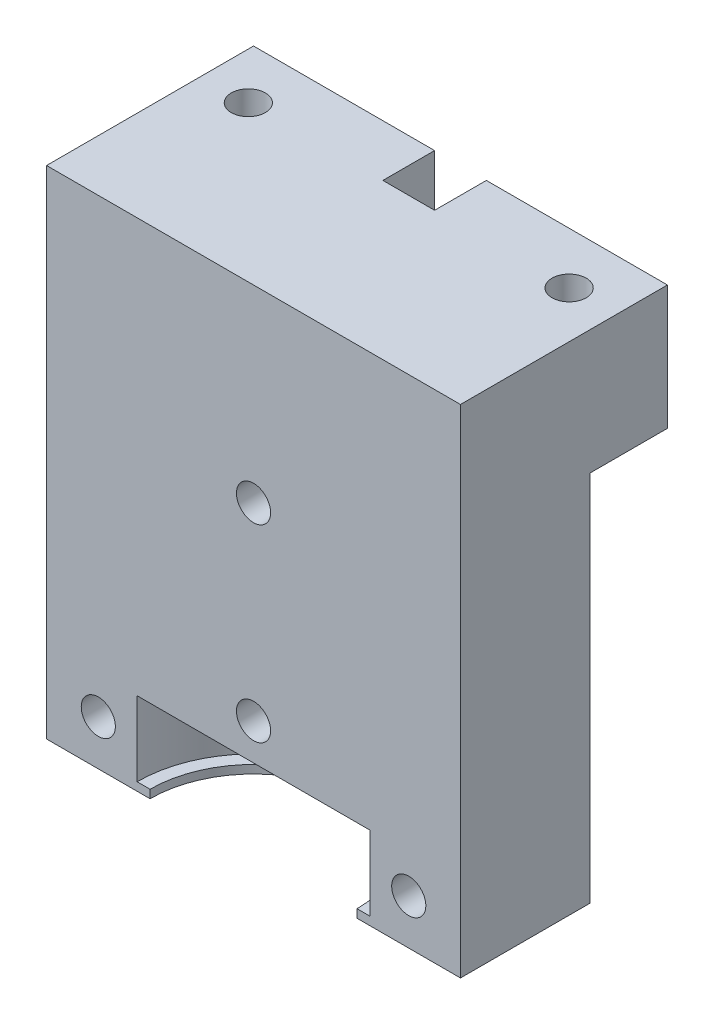
ISO-10303-21;
HEADER;
FILE_DESCRIPTION(('STEP AP214'),'2;1');
FILE_NAME('part.step','',(''),(''),'','','');
FILE_SCHEMA(('AUTOMOTIVE_DESIGN { 1 0 10303 214 1 1 1 1 }'));
ENDSEC;
DATA;
#1=APPLICATION_CONTEXT('core data for automotive mechanical design processes');
#2=APPLICATION_PROTOCOL_DEFINITION('international standard','automotive_design',2000,#1);
#3=PRODUCT_CONTEXT('',#1,'mechanical');
#4=PRODUCT('Part','Part','',(#3));
#5=PRODUCT_RELATED_PRODUCT_CATEGORY('part','',(#4));
#6=PRODUCT_DEFINITION_FORMATION('','',#4);
#7=PRODUCT_DEFINITION_CONTEXT('part definition',#1,'design');
#8=PRODUCT_DEFINITION('design','',#6,#7);
#9=PRODUCT_DEFINITION_SHAPE('','',#8);
#10=(LENGTH_UNIT() NAMED_UNIT(*) SI_UNIT(.MILLI.,.METRE.));
#11=(NAMED_UNIT(*) PLANE_ANGLE_UNIT() SI_UNIT($,.RADIAN.));
#12=(NAMED_UNIT(*) SI_UNIT($,.STERADIAN.) SOLID_ANGLE_UNIT());
#13=UNCERTAINTY_MEASURE_WITH_UNIT(LENGTH_MEASURE(1.E-05),#10,'distance_accuracy_value','');
#14=(GEOMETRIC_REPRESENTATION_CONTEXT(3) GLOBAL_UNCERTAINTY_ASSIGNED_CONTEXT((#13)) GLOBAL_UNIT_ASSIGNED_CONTEXT((#10,
#11,#12)) REPRESENTATION_CONTEXT('',''));
#15=CARTESIAN_POINT('',(0.,0.,0.));
#16=DIRECTION('',(0.,0.,1.));
#17=DIRECTION('',(1.,0.,0.));
#18=AXIS2_PLACEMENT_3D('',#15,#16,#17);
#19=CARTESIAN_POINT('',(20.,-48.,-20.));
#20=DIRECTION('',(0.,0.,-1.));
#21=DIRECTION('',(-1.,0.,0.));
#22=AXIS2_PLACEMENT_3D('',#19,#20,#21);
#23=PLANE('',#22);
#24=DIRECTION('',(0.,-1.,0.));
#25=VECTOR('',#24,1.);
#26=CARTESIAN_POINT('',(-2.5,0.,-20.));
#27=LINE('',#26,#25);
#28=CARTESIAN_POINT('',(-2.5,0.,-20.));
#29=VERTEX_POINT('',#28);
#30=CARTESIAN_POINT('',(-2.5,-12.,-20.));
#31=VERTEX_POINT('',#30);
#32=EDGE_CURVE('E140',#29,#31,#27,.T.);
#33=ORIENTED_EDGE('',*,*,#32,.T.);
#34=DIRECTION('',(1.,0.,0.));
#35=VECTOR('',#34,1.);
#36=CARTESIAN_POINT('',(-20.,-12.,-20.));
#37=LINE('',#36,#35);
#38=CARTESIAN_POINT('',(-20.,-12.,-20.));
#39=VERTEX_POINT('',#38);
#40=EDGE_CURVE('E289',#39,#31,#37,.T.);
#41=ORIENTED_EDGE('',*,*,#40,.F.);
#42=DIRECTION('',(0.,1.,0.));
#43=VECTOR('',#42,1.);
#44=CARTESIAN_POINT('',(-20.,-48.,-20.));
#45=LINE('',#44,#43);
#46=CARTESIAN_POINT('',(-20.,0.,-20.));
#47=VERTEX_POINT('',#46);
#48=EDGE_CURVE('E164',#39,#47,#45,.T.);
#49=ORIENTED_EDGE('',*,*,#48,.T.);
#50=DIRECTION('',(-1.,0.,0.));
#51=VECTOR('',#50,1.);
#52=CARTESIAN_POINT('',(20.,0.,-20.));
#53=LINE('',#52,#51);
#54=EDGE_CURVE('E156',#29,#47,#53,.T.);
#55=ORIENTED_EDGE('',*,*,#54,.F.);
#56=EDGE_LOOP('',(#33,#41,#49,#55));
#57=FACE_BOUND('',#56,.T.);
#58=ADVANCED_FACE('F35',(#57),#23,.T.);
#59=DIRECTION('',(0.,-1.,0.));
#60=VECTOR('',#59,1.);
#61=CARTESIAN_POINT('',(2.5,0.,-20.));
#62=LINE('',#61,#60);
#63=CARTESIAN_POINT('',(2.5,0.,-20.));
#64=VERTEX_POINT('',#63);
#65=CARTESIAN_POINT('',(2.5,-12.,-20.));
#66=VERTEX_POINT('',#65);
#67=EDGE_CURVE('E52',#64,#66,#62,.T.);
#68=ORIENTED_EDGE('',*,*,#67,.F.);
#69=CARTESIAN_POINT('',(20.,0.,-20.));
#70=VERTEX_POINT('',#69);
#71=EDGE_CURVE('E166',#70,#64,#53,.T.);
#72=ORIENTED_EDGE('',*,*,#71,.F.);
#73=DIRECTION('',(0.,1.,0.));
#74=VECTOR('',#73,1.);
#75=CARTESIAN_POINT('',(20.,-48.,-20.));
#76=LINE('',#75,#74);
#77=CARTESIAN_POINT('',(20.,-12.,-20.));
#78=VERTEX_POINT('',#77);
#79=EDGE_CURVE('E178',#78,#70,#76,.T.);
#80=ORIENTED_EDGE('',*,*,#79,.F.);
#81=EDGE_CURVE('E279',#66,#78,#37,.T.);
#82=ORIENTED_EDGE('',*,*,#81,.F.);
#83=EDGE_LOOP('',(#68,#72,#80,#82));
#84=FACE_BOUND('',#83,.T.);
#85=ADVANCED_FACE('F303',(#84),#23,.T.);
#86=CARTESIAN_POINT('',(15.5,0.,-15.));
#87=DIRECTION('',(0.,1.,0.));
#88=DIRECTION('',(0.,0.,1.));
#89=AXIS2_PLACEMENT_3D('',#86,#87,#88);
#90=CYLINDRICAL_SURFACE('',#89,1.64999999999999);
#91=CARTESIAN_POINT('',(15.5,0.,-15.));
#92=DIRECTION('',(0.,1.,0.));
#93=DIRECTION('',(0.,0.,1.));
#94=AXIS2_PLACEMENT_3D('',#91,#92,#93);
#95=CIRCLE('',#94,1.64999999999999);
#96=CARTESIAN_POINT('',(15.5,0.,-13.35));
#97=VERTEX_POINT('',#96);
#98=EDGE_CURVE('E255',#97,#97,#95,.T.);
#99=ORIENTED_EDGE('',*,*,#98,.T.);
#100=EDGE_LOOP('',(#99));
#101=FACE_BOUND('',#100,.T.);
#102=CARTESIAN_POINT('',(15.5,-12.,-15.));
#103=DIRECTION('',(0.,-1.,0.));
#104=DIRECTION('',(0.,0.,-1.));
#105=AXIS2_PLACEMENT_3D('',#102,#103,#104);
#106=CIRCLE('',#105,1.64999999999999);
#107=CARTESIAN_POINT('',(15.5,-12.,-16.65));
#108=VERTEX_POINT('',#107);
#109=EDGE_CURVE('E211',#108,#108,#106,.F.);
#110=ORIENTED_EDGE('',*,*,#109,.F.);
#111=EDGE_LOOP('',(#110));
#112=FACE_BOUND('',#111,.T.);
#113=ADVANCED_FACE('F324',(#101,#112),#90,.F.);
#114=CARTESIAN_POINT('',(-15.5,0.,-15.));
#115=DIRECTION('',(0.,1.,0.));
#116=DIRECTION('',(0.,0.,1.));
#117=AXIS2_PLACEMENT_3D('',#114,#115,#116);
#118=CYLINDRICAL_SURFACE('',#117,1.64999999999999);
#119=CARTESIAN_POINT('',(-15.5,0.,-15.));
#120=DIRECTION('',(0.,1.,0.));
#121=DIRECTION('',(0.,0.,1.));
#122=AXIS2_PLACEMENT_3D('',#119,#120,#121);
#123=CIRCLE('',#122,1.64999999999999);
#124=CARTESIAN_POINT('',(-15.5,0.,-13.35));
#125=VERTEX_POINT('',#124);
#126=EDGE_CURVE('E251',#125,#125,#123,.T.);
#127=ORIENTED_EDGE('',*,*,#126,.T.);
#128=EDGE_LOOP('',(#127));
#129=FACE_BOUND('',#128,.T.);
#130=CARTESIAN_POINT('',(-15.5,-12.,-15.));
#131=DIRECTION('',(0.,-1.,0.));
#132=DIRECTION('',(0.,0.,-1.));
#133=AXIS2_PLACEMENT_3D('',#130,#131,#132);
#134=CIRCLE('',#133,1.64999999999999);
#135=CARTESIAN_POINT('',(-15.5,-12.,-16.65));
#136=VERTEX_POINT('',#135);
#137=EDGE_CURVE('E39',#136,#136,#134,.F.);
#138=ORIENTED_EDGE('',*,*,#137,.F.);
#139=EDGE_LOOP('',(#138));
#140=FACE_BOUND('',#139,.T.);
#141=ADVANCED_FACE('F335',(#129,#140),#118,.F.);
#142=CARTESIAN_POINT('',(-20.,-48.,0.));
#143=DIRECTION('',(0.,0.,-1.));
#144=DIRECTION('',(-1.,0.,0.));
#145=AXIS2_PLACEMENT_3D('',#142,#143,#144);
#146=PLANE('',#145);
#147=CARTESIAN_POINT('',(-15.,-43.628125,0.));
#148=DIRECTION('',(0.,0.,-1.));
#149=DIRECTION('',(-1.,0.,0.));
#150=AXIS2_PLACEMENT_3D('',#147,#148,#149);
#151=CIRCLE('',#150,1.65);
#152=CARTESIAN_POINT('',(-16.65,-43.628125,0.));
#153=VERTEX_POINT('',#152);
#154=EDGE_CURVE('E214',#153,#153,#151,.T.);
#155=ORIENTED_EDGE('',*,*,#154,.T.);
#156=EDGE_LOOP('',(#155));
#157=FACE_BOUND('',#156,.T.);
#158=CARTESIAN_POINT('',(15.,-43.628125,0.));
#159=DIRECTION('',(0.,0.,-1.));
#160=DIRECTION('',(-1.,0.,0.));
#161=AXIS2_PLACEMENT_3D('',#158,#159,#160);
#162=CIRCLE('',#161,1.65);
#163=CARTESIAN_POINT('',(13.35,-43.628125,0.));
#164=VERTEX_POINT('',#163);
#165=EDGE_CURVE('E217',#164,#164,#162,.T.);
#166=ORIENTED_EDGE('',*,*,#165,.T.);
#167=EDGE_LOOP('',(#166));
#168=FACE_BOUND('',#167,.T.);
#169=CARTESIAN_POINT('',(0.,-36.484375,0.));
#170=DIRECTION('',(0.,0.,-1.));
#171=DIRECTION('',(-1.,0.,0.));
#172=AXIS2_PLACEMENT_3D('',#169,#170,#171);
#173=CIRCLE('',#172,1.65);
#174=CARTESIAN_POINT('',(-1.65,-36.484375,0.));
#175=VERTEX_POINT('',#174);
#176=EDGE_CURVE('E220',#175,#175,#173,.T.);
#177=ORIENTED_EDGE('',*,*,#176,.T.);
#178=EDGE_LOOP('',(#177));
#179=FACE_BOUND('',#178,.T.);
#180=CARTESIAN_POINT('',(0.,-18.2421875,0.));
#181=DIRECTION('',(0.,0.,-1.));
#182=DIRECTION('',(-1.,0.,0.));
#183=AXIS2_PLACEMENT_3D('',#180,#181,#182);
#184=CIRCLE('',#183,1.65);
#185=CARTESIAN_POINT('',(-1.65,-18.2421875,0.));
#186=VERTEX_POINT('',#185);
#187=EDGE_CURVE('E223',#186,#186,#184,.T.);
#188=ORIENTED_EDGE('',*,*,#187,.T.);
#189=EDGE_LOOP('',(#188));
#190=FACE_BOUND('',#189,.T.);
#191=DIRECTION('',(1.,0.,0.));
#192=VECTOR('',#191,1.);
#193=CARTESIAN_POINT('',(-20.,-47.2,0.));
#194=LINE('',#193,#192);
#195=CARTESIAN_POINT('',(10.,-47.2,0.));
#196=VERTEX_POINT('',#195);
#197=CARTESIAN_POINT('',(11.25,-47.2,0.));
#198=VERTEX_POINT('',#197);
#199=EDGE_CURVE('E44',#196,#198,#194,.T.);
#200=ORIENTED_EDGE('',*,*,#199,.F.);
#201=DIRECTION('',(0.,-1.,0.));
#202=VECTOR('',#201,1.);
#203=CARTESIAN_POINT('',(10.,0.001000000000001,0.));
#204=LINE('',#203,#202);
#205=CARTESIAN_POINT('',(10.,-48.,0.));
#206=VERTEX_POINT('',#205);
#207=EDGE_CURVE('E228',#206,#196,#204,.F.);
#208=ORIENTED_EDGE('',*,*,#207,.F.);
#209=DIRECTION('',(-1.,0.,0.));
#210=VECTOR('',#209,1.);
#211=CARTESIAN_POINT('',(-20.,-48.,0.));
#212=LINE('',#211,#210);
#213=CARTESIAN_POINT('',(20.,-48.,0.));
#214=VERTEX_POINT('',#213);
#215=EDGE_CURVE('E242',#214,#206,#212,.T.);
#216=ORIENTED_EDGE('',*,*,#215,.F.);
#217=DIRECTION('',(0.,1.,0.));
#218=VECTOR('',#217,1.);
#219=CARTESIAN_POINT('',(20.,-48.,0.));
#220=LINE('',#219,#218);
#221=CARTESIAN_POINT('',(20.,0.,0.));
#222=VERTEX_POINT('',#221);
#223=EDGE_CURVE('E245',#214,#222,#220,.T.);
#224=ORIENTED_EDGE('',*,*,#223,.T.);
#225=DIRECTION('',(-1.,0.,0.));
#226=VECTOR('',#225,1.);
#227=CARTESIAN_POINT('',(-20.,0.,0.));
#228=LINE('',#227,#226);
#229=CARTESIAN_POINT('',(-20.,0.,0.));
#230=VERTEX_POINT('',#229);
#231=EDGE_CURVE('E241',#222,#230,#228,.T.);
#232=ORIENTED_EDGE('',*,*,#231,.T.);
#233=DIRECTION('',(0.,1.,0.));
#234=VECTOR('',#233,1.);
#235=CARTESIAN_POINT('',(-20.,-48.,0.));
#236=LINE('',#235,#234);
#237=CARTESIAN_POINT('',(-20.,-48.,0.));
#238=VERTEX_POINT('',#237);
#239=EDGE_CURVE('E248',#238,#230,#236,.T.);
#240=ORIENTED_EDGE('',*,*,#239,.F.);
#241=CARTESIAN_POINT('',(-10.,-48.,0.));
#242=VERTEX_POINT('',#241);
#243=EDGE_CURVE('E246',#242,#238,#212,.T.);
#244=ORIENTED_EDGE('',*,*,#243,.F.);
#245=DIRECTION('',(0.,-1.,0.));
#246=VECTOR('',#245,1.);
#247=CARTESIAN_POINT('',(-10.,0.001000000000001,0.));
#248=LINE('',#247,#246);
#249=CARTESIAN_POINT('',(-10.,-47.2,0.));
#250=VERTEX_POINT('',#249);
#251=EDGE_CURVE('E226',#250,#242,#248,.T.);
#252=ORIENTED_EDGE('',*,*,#251,.F.);
#253=CARTESIAN_POINT('',(-11.25,-47.2,0.));
#254=VERTEX_POINT('',#253);
#255=EDGE_CURVE('E11',#254,#250,#194,.T.);
#256=ORIENTED_EDGE('',*,*,#255,.F.);
#257=DIRECTION('',(0.,1.,0.));
#258=VECTOR('',#257,1.);
#259=CARTESIAN_POINT('',(-11.25,0.,0.));
#260=LINE('',#259,#258);
#261=CARTESIAN_POINT('',(-11.25,-40.,0.));
#262=VERTEX_POINT('',#261);
#263=EDGE_CURVE('E185',#262,#254,#260,.F.);
#264=ORIENTED_EDGE('',*,*,#263,.F.);
#265=DIRECTION('',(-1.,0.,0.));
#266=VECTOR('',#265,1.);
#267=CARTESIAN_POINT('',(-20.,-40.,0.));
#268=LINE('',#267,#266);
#269=CARTESIAN_POINT('',(11.25,-40.,0.));
#270=VERTEX_POINT('',#269);
#271=EDGE_CURVE('E177',#270,#262,#268,.T.);
#272=ORIENTED_EDGE('',*,*,#271,.F.);
#273=DIRECTION('',(0.,1.,0.));
#274=VECTOR('',#273,1.);
#275=CARTESIAN_POINT('',(11.25,0.,0.));
#276=LINE('',#275,#274);
#277=EDGE_CURVE('E182',#198,#270,#276,.T.);
#278=ORIENTED_EDGE('',*,*,#277,.F.);
#279=EDGE_LOOP('',(#200,#208,#216,#224,#232,#240,#244,#252,#256,#264,#272,#278));
#280=FACE_BOUND('',#279,.T.);
#281=ADVANCED_FACE('F267',(#157,#168,#179,#190,#280),#146,.F.);
#282=CARTESIAN_POINT('',(-20.,-48.,-20.));
#283=DIRECTION('',(-1.,0.,0.));
#284=DIRECTION('',(0.,0.,1.));
#285=AXIS2_PLACEMENT_3D('',#282,#283,#284);
#286=PLANE('',#285);
#287=DIRECTION('',(0.,-1.,0.));
#288=VECTOR('',#287,1.);
#289=CARTESIAN_POINT('',(-20.,-12.,-12.5));
#290=LINE('',#289,#288);
#291=CARTESIAN_POINT('',(-20.,-12.,-12.5));
#292=VERTEX_POINT('',#291);
#293=CARTESIAN_POINT('',(-20.,-48.,-12.5));
#294=VERTEX_POINT('',#293);
#295=EDGE_CURVE('E189',#292,#294,#290,.T.);
#296=ORIENTED_EDGE('',*,*,#295,.T.);
#297=DIRECTION('',(0.,0.,1.));
#298=VECTOR('',#297,1.);
#299=CARTESIAN_POINT('',(-20.,-48.,-20.));
#300=LINE('',#299,#298);
#301=EDGE_CURVE('E170',#294,#238,#300,.T.);
#302=ORIENTED_EDGE('',*,*,#301,.T.);
#303=ORIENTED_EDGE('',*,*,#239,.T.);
#304=DIRECTION('',(0.,0.,1.));
#305=VECTOR('',#304,1.);
#306=CARTESIAN_POINT('',(-20.,0.,-20.));
#307=LINE('',#306,#305);
#308=EDGE_CURVE('E172',#47,#230,#307,.T.);
#309=ORIENTED_EDGE('',*,*,#308,.F.);
#310=ORIENTED_EDGE('',*,*,#48,.F.);
#311=DIRECTION('',(0.,0.,-1.));
#312=VECTOR('',#311,1.);
#313=CARTESIAN_POINT('',(-20.,-12.,-12.5));
#314=LINE('',#313,#312);
#315=EDGE_CURVE('E277',#292,#39,#314,.T.);
#316=ORIENTED_EDGE('',*,*,#315,.F.);
#317=EDGE_LOOP('',(#296,#302,#303,#309,#310,#316));
#318=FACE_BOUND('',#317,.T.);
#319=ADVANCED_FACE('F37',(#318),#286,.T.);
#320=CARTESIAN_POINT('',(20.,-48.,-20.));
#321=DIRECTION('',(1.,0.,0.));
#322=DIRECTION('',(0.,0.,-1.));
#323=AXIS2_PLACEMENT_3D('',#320,#321,#322);
#324=PLANE('',#323);
#325=DIRECTION('',(0.,-1.,0.));
#326=VECTOR('',#325,1.);
#327=CARTESIAN_POINT('',(20.,-12.,-12.5));
#328=LINE('',#327,#326);
#329=CARTESIAN_POINT('',(20.,-12.,-12.5));
#330=VERTEX_POINT('',#329);
#331=CARTESIAN_POINT('',(20.,-48.,-12.5));
#332=VERTEX_POINT('',#331);
#333=EDGE_CURVE('E60',#330,#332,#328,.T.);
#334=ORIENTED_EDGE('',*,*,#333,.F.);
#335=DIRECTION('',(0.,0.,1.));
#336=VECTOR('',#335,1.);
#337=CARTESIAN_POINT('',(20.,-12.,-12.5));
#338=LINE('',#337,#336);
#339=EDGE_CURVE('E291',#78,#330,#338,.T.);
#340=ORIENTED_EDGE('',*,*,#339,.F.);
#341=ORIENTED_EDGE('',*,*,#79,.T.);
#342=DIRECTION('',(0.,0.,-1.));
#343=VECTOR('',#342,1.);
#344=CARTESIAN_POINT('',(20.,0.,-20.));
#345=LINE('',#344,#343);
#346=EDGE_CURVE('E167',#222,#70,#345,.T.);
#347=ORIENTED_EDGE('',*,*,#346,.F.);
#348=ORIENTED_EDGE('',*,*,#223,.F.);
#349=DIRECTION('',(0.,0.,-1.));
#350=VECTOR('',#349,1.);
#351=CARTESIAN_POINT('',(20.,-48.,-20.));
#352=LINE('',#351,#350);
#353=EDGE_CURVE('E180',#214,#332,#352,.T.);
#354=ORIENTED_EDGE('',*,*,#353,.T.);
#355=EDGE_LOOP('',(#334,#340,#341,#347,#348,#354));
#356=FACE_BOUND('',#355,.T.);
#357=ADVANCED_FACE('F273',(#356),#324,.T.);
#358=CARTESIAN_POINT('',(0.,-48.,0.));
#359=DIRECTION('',(0.,-1.,0.));
#360=DIRECTION('',(0.,0.,-1.));
#361=AXIS2_PLACEMENT_3D('',#358,#359,#360);
#362=PLANE('',#361);
#363=DIRECTION('',(-1.,0.,0.));
#364=VECTOR('',#363,1.);
#365=CARTESIAN_POINT('',(-20.,-48.,-12.5));
#366=LINE('',#365,#364);
#367=EDGE_CURVE('E203',#332,#294,#366,.T.);
#368=ORIENTED_EDGE('',*,*,#367,.F.);
#369=ORIENTED_EDGE('',*,*,#353,.F.);
#370=ORIENTED_EDGE('',*,*,#215,.T.);
#371=CARTESIAN_POINT('',(0.,-48.,0.));
#372=DIRECTION('',(0.,-1.,0.));
#373=DIRECTION('',(0.,0.,-1.));
#374=AXIS2_PLACEMENT_3D('',#371,#372,#373);
#375=CIRCLE('',#374,10.);
#376=EDGE_CURVE('E230',#242,#206,#375,.T.);
#377=ORIENTED_EDGE('',*,*,#376,.F.);
#378=ORIENTED_EDGE('',*,*,#243,.T.);
#379=ORIENTED_EDGE('',*,*,#301,.F.);
#380=EDGE_LOOP('',(#368,#369,#370,#377,#378,#379));
#381=FACE_BOUND('',#380,.T.);
#382=ADVANCED_FACE('F275',(#381),#362,.T.);
#383=CARTESIAN_POINT('',(0.,0.,0.));
#384=DIRECTION('',(0.,-1.,0.));
#385=DIRECTION('',(0.,0.,-1.));
#386=AXIS2_PLACEMENT_3D('',#383,#384,#385);
#387=PLANE('',#386);
#388=ORIENTED_EDGE('',*,*,#126,.F.);
#389=EDGE_LOOP('',(#388));
#390=FACE_BOUND('',#389,.T.);
#391=ORIENTED_EDGE('',*,*,#98,.F.);
#392=EDGE_LOOP('',(#391));
#393=FACE_BOUND('',#392,.T.);
#394=DIRECTION('',(-1.,0.,0.));
#395=VECTOR('',#394,1.);
#396=CARTESIAN_POINT('',(-2.5,0.,-15.));
#397=LINE('',#396,#395);
#398=CARTESIAN_POINT('',(2.5,0.,-15.));
#399=VERTEX_POINT('',#398);
#400=CARTESIAN_POINT('',(-2.5,0.,-15.));
#401=VERTEX_POINT('',#400);
#402=EDGE_CURVE('E151',#399,#401,#397,.T.);
#403=ORIENTED_EDGE('',*,*,#402,.T.);
#404=DIRECTION('',(0.,0.,-1.));
#405=VECTOR('',#404,1.);
#406=CARTESIAN_POINT('',(-2.5,0.,-20.));
#407=LINE('',#406,#405);
#408=EDGE_CURVE('E143',#401,#29,#407,.T.);
#409=ORIENTED_EDGE('',*,*,#408,.T.);
#410=ORIENTED_EDGE('',*,*,#54,.T.);
#411=ORIENTED_EDGE('',*,*,#308,.T.);
#412=ORIENTED_EDGE('',*,*,#231,.F.);
#413=ORIENTED_EDGE('',*,*,#346,.T.);
#414=ORIENTED_EDGE('',*,*,#71,.T.);
#415=DIRECTION('',(0.,0.,1.));
#416=VECTOR('',#415,1.);
#417=CARTESIAN_POINT('',(2.5,0.,-20.));
#418=LINE('',#417,#416);
#419=EDGE_CURVE('E160',#64,#399,#418,.T.);
#420=ORIENTED_EDGE('',*,*,#419,.T.);
#421=EDGE_LOOP('',(#403,#409,#410,#411,#412,#413,#414,#420));
#422=FACE_BOUND('',#421,.T.);
#423=ADVANCED_FACE('F154',(#390,#393,#422),#387,.F.);
#424=CARTESIAN_POINT('',(0.,-47.2,0.));
#425=DIRECTION('',(0.,1.,0.));
#426=DIRECTION('',(-1.,0.,0.));
#427=AXIS2_PLACEMENT_3D('',#424,#425,#426);
#428=PLANE('',#427);
#429=CARTESIAN_POINT('',(0.,-47.2,0.));
#430=DIRECTION('',(0.,1.,0.));
#431=DIRECTION('',(-1.,0.,0.));
#432=AXIS2_PLACEMENT_3D('',#429,#430,#431);
#433=CIRCLE('',#432,10.);
#434=EDGE_CURVE('E232',#250,#196,#433,.F.);
#435=ORIENTED_EDGE('',*,*,#434,.T.);
#436=ORIENTED_EDGE('',*,*,#199,.T.);
#437=CARTESIAN_POINT('',(0.,-47.2,0.));
#438=DIRECTION('',(0.,1.,0.));
#439=DIRECTION('',(-1.,0.,0.));
#440=AXIS2_PLACEMENT_3D('',#437,#438,#439);
#441=CIRCLE('',#440,11.25);
#442=EDGE_CURVE('E238',#198,#254,#441,.T.);
#443=ORIENTED_EDGE('',*,*,#442,.T.);
#444=ORIENTED_EDGE('',*,*,#255,.T.);
#445=EDGE_LOOP('',(#435,#436,#443,#444));
#446=FACE_BOUND('',#445,.T.);
#447=ADVANCED_FACE('F345',(#446),#428,.T.);
#448=CARTESIAN_POINT('',(0.,0.,0.));
#449=DIRECTION('',(0.,1.,0.));
#450=DIRECTION('',(-1.,0.,0.));
#451=AXIS2_PLACEMENT_3D('',#448,#449,#450);
#452=CYLINDRICAL_SURFACE('',#451,11.25);
#453=ORIENTED_EDGE('',*,*,#263,.T.);
#454=ORIENTED_EDGE('',*,*,#442,.F.);
#455=ORIENTED_EDGE('',*,*,#277,.T.);
#456=CARTESIAN_POINT('',(0.,-40.,0.));
#457=DIRECTION('',(0.,1.,0.));
#458=DIRECTION('',(-1.,0.,0.));
#459=AXIS2_PLACEMENT_3D('',#456,#457,#458);
#460=CIRCLE('',#459,11.25);
#461=EDGE_CURVE('E235',#270,#262,#460,.T.);
#462=ORIENTED_EDGE('',*,*,#461,.T.);
#463=EDGE_LOOP('',(#453,#454,#455,#462));
#464=FACE_BOUND('',#463,.T.);
#465=ADVANCED_FACE('F385',(#464),#452,.F.);
#466=CARTESIAN_POINT('',(0.,-40.,0.));
#467=DIRECTION('',(0.,-1.,0.));
#468=DIRECTION('',(1.,0.,0.));
#469=AXIS2_PLACEMENT_3D('',#466,#467,#468);
#470=PLANE('',#469);
#471=ORIENTED_EDGE('',*,*,#271,.T.);
#472=ORIENTED_EDGE('',*,*,#461,.F.);
#473=EDGE_LOOP('',(#471,#472));
#474=FACE_BOUND('',#473,.T.);
#475=ADVANCED_FACE('F382',(#474),#470,.T.);
#476=CARTESIAN_POINT('',(0.,0.001000000000001,0.));
#477=DIRECTION('',(0.,-1.,0.));
#478=DIRECTION('',(0.,0.,-1.));
#479=AXIS2_PLACEMENT_3D('',#476,#477,#478);
#480=CYLINDRICAL_SURFACE('',#479,10.);
#481=ORIENTED_EDGE('',*,*,#207,.T.);
#482=ORIENTED_EDGE('',*,*,#434,.F.);
#483=ORIENTED_EDGE('',*,*,#251,.T.);
#484=ORIENTED_EDGE('',*,*,#376,.T.);
#485=EDGE_LOOP('',(#481,#482,#483,#484));
#486=FACE_BOUND('',#485,.T.);
#487=ADVANCED_FACE('F378',(#486),#480,.F.);
#488=CARTESIAN_POINT('',(0.,-18.2421875,-20.));
#489=DIRECTION('',(0.,0.,-1.));
#490=DIRECTION('',(-1.,0.,0.));
#491=AXIS2_PLACEMENT_3D('',#488,#489,#490);
#492=CYLINDRICAL_SURFACE('',#491,1.65);
#493=CARTESIAN_POINT('',(0.,-18.2421875,-12.5));
#494=DIRECTION('',(0.,0.,1.));
#495=DIRECTION('',(1.,0.,0.));
#496=AXIS2_PLACEMENT_3D('',#493,#494,#495);
#497=CIRCLE('',#496,1.65);
#498=CARTESIAN_POINT('',(1.65,-18.2421875,-12.5));
#499=VERTEX_POINT('',#498);
#500=EDGE_CURVE('E208',#499,#499,#497,.F.);
#501=ORIENTED_EDGE('',*,*,#500,.T.);
#502=EDGE_LOOP('',(#501));
#503=FACE_BOUND('',#502,.T.);
#504=ORIENTED_EDGE('',*,*,#187,.F.);
#505=EDGE_LOOP('',(#504));
#506=FACE_BOUND('',#505,.T.);
#507=ADVANCED_FACE('F374',(#503,#506),#492,.F.);
#508=CARTESIAN_POINT('',(0.,-36.484375,-20.));
#509=DIRECTION('',(0.,0.,-1.));
#510=DIRECTION('',(-1.,0.,0.));
#511=AXIS2_PLACEMENT_3D('',#508,#509,#510);
#512=CYLINDRICAL_SURFACE('',#511,1.65);
#513=CARTESIAN_POINT('',(0.,-36.484375,-12.5));
#514=DIRECTION('',(0.,0.,1.));
#515=DIRECTION('',(1.,0.,0.));
#516=AXIS2_PLACEMENT_3D('',#513,#514,#515);
#517=CIRCLE('',#516,1.65);
#518=CARTESIAN_POINT('',(1.65,-36.484375,-12.5));
#519=VERTEX_POINT('',#518);
#520=EDGE_CURVE('E193',#519,#519,#517,.F.);
#521=ORIENTED_EDGE('',*,*,#520,.T.);
#522=EDGE_LOOP('',(#521));
#523=FACE_BOUND('',#522,.T.);
#524=ORIENTED_EDGE('',*,*,#176,.F.);
#525=EDGE_LOOP('',(#524));
#526=FACE_BOUND('',#525,.T.);
#527=ADVANCED_FACE('F370',(#523,#526),#512,.F.);
#528=CARTESIAN_POINT('',(15.,-43.628125,-20.));
#529=DIRECTION('',(0.,0.,-1.));
#530=DIRECTION('',(-1.,0.,0.));
#531=AXIS2_PLACEMENT_3D('',#528,#529,#530);
#532=CYLINDRICAL_SURFACE('',#531,1.65);
#533=CARTESIAN_POINT('',(15.,-43.628125,-12.5));
#534=DIRECTION('',(0.,0.,1.));
#535=DIRECTION('',(1.,0.,0.));
#536=AXIS2_PLACEMENT_3D('',#533,#534,#535);
#537=CIRCLE('',#536,1.65);
#538=CARTESIAN_POINT('',(16.65,-43.628125,-12.5));
#539=VERTEX_POINT('',#538);
#540=EDGE_CURVE('E188',#539,#539,#537,.F.);
#541=ORIENTED_EDGE('',*,*,#540,.T.);
#542=EDGE_LOOP('',(#541));
#543=FACE_BOUND('',#542,.T.);
#544=ORIENTED_EDGE('',*,*,#165,.F.);
#545=EDGE_LOOP('',(#544));
#546=FACE_BOUND('',#545,.T.);
#547=ADVANCED_FACE('F365',(#543,#546),#532,.F.);
#548=CARTESIAN_POINT('',(-15.,-43.628125,-20.));
#549=DIRECTION('',(0.,0.,-1.));
#550=DIRECTION('',(-1.,0.,0.));
#551=AXIS2_PLACEMENT_3D('',#548,#549,#550);
#552=CYLINDRICAL_SURFACE('',#551,1.65);
#553=CARTESIAN_POINT('',(-15.,-43.628125,-12.5));
#554=DIRECTION('',(0.,0.,1.));
#555=DIRECTION('',(1.,0.,0.));
#556=AXIS2_PLACEMENT_3D('',#553,#554,#555);
#557=CIRCLE('',#556,1.65);
#558=CARTESIAN_POINT('',(-13.35,-43.628125,-12.5));
#559=VERTEX_POINT('',#558);
#560=EDGE_CURVE('E186',#559,#559,#557,.F.);
#561=ORIENTED_EDGE('',*,*,#560,.T.);
#562=EDGE_LOOP('',(#561));
#563=FACE_BOUND('',#562,.T.);
#564=ORIENTED_EDGE('',*,*,#154,.F.);
#565=EDGE_LOOP('',(#564));
#566=FACE_BOUND('',#565,.T.);
#567=ADVANCED_FACE('F357',(#563,#566),#552,.F.);
#568=CARTESIAN_POINT('',(0.,-12.,0.));
#569=DIRECTION('',(0.,-1.,0.));
#570=DIRECTION('',(0.,0.,-1.));
#571=AXIS2_PLACEMENT_3D('',#568,#569,#570);
#572=PLANE('',#571);
#573=DIRECTION('',(0.,0.,-1.));
#574=VECTOR('',#573,1.);
#575=CARTESIAN_POINT('',(-2.5,-12.,-20.));
#576=LINE('',#575,#574);
#577=CARTESIAN_POINT('',(-2.5,-12.,-15.));
#578=VERTEX_POINT('',#577);
#579=EDGE_CURVE('E146',#578,#31,#576,.T.);
#580=ORIENTED_EDGE('',*,*,#579,.F.);
#581=DIRECTION('',(-1.,0.,0.));
#582=VECTOR('',#581,1.);
#583=CARTESIAN_POINT('',(-2.5,-12.,-15.));
#584=LINE('',#583,#582);
#585=CARTESIAN_POINT('',(2.5,-12.,-15.));
#586=VERTEX_POINT('',#585);
#587=EDGE_CURVE('E161',#586,#578,#584,.T.);
#588=ORIENTED_EDGE('',*,*,#587,.F.);
#589=DIRECTION('',(0.,0.,1.));
#590=VECTOR('',#589,1.);
#591=CARTESIAN_POINT('',(2.5,-12.,-20.));
#592=LINE('',#591,#590);
#593=EDGE_CURVE('E307',#66,#586,#592,.T.);
#594=ORIENTED_EDGE('',*,*,#593,.F.);
#595=ORIENTED_EDGE('',*,*,#81,.T.);
#596=ORIENTED_EDGE('',*,*,#339,.T.);
#597=DIRECTION('',(-1.,0.,0.));
#598=VECTOR('',#597,1.);
#599=CARTESIAN_POINT('',(-20.,-12.,-12.5));
#600=LINE('',#599,#598);
#601=EDGE_CURVE('E200',#330,#292,#600,.T.);
#602=ORIENTED_EDGE('',*,*,#601,.T.);
#603=ORIENTED_EDGE('',*,*,#315,.T.);
#604=ORIENTED_EDGE('',*,*,#40,.T.);
#605=EDGE_LOOP('',(#580,#588,#594,#595,#596,#602,#603,#604));
#606=FACE_BOUND('',#605,.T.);
#607=ORIENTED_EDGE('',*,*,#137,.T.);
#608=EDGE_LOOP('',(#607));
#609=FACE_BOUND('',#608,.T.);
#610=ORIENTED_EDGE('',*,*,#109,.T.);
#611=EDGE_LOOP('',(#610));
#612=FACE_BOUND('',#611,.T.);
#613=ADVANCED_FACE('F294',(#606,#609,#612),#572,.T.);
#614=CARTESIAN_POINT('',(-20.,-12.,-12.5));
#615=DIRECTION('',(0.,0.,1.));
#616=DIRECTION('',(1.,0.,0.));
#617=AXIS2_PLACEMENT_3D('',#614,#615,#616);
#618=PLANE('',#617);
#619=ORIENTED_EDGE('',*,*,#520,.F.);
#620=EDGE_LOOP('',(#619));
#621=FACE_BOUND('',#620,.T.);
#622=ORIENTED_EDGE('',*,*,#560,.F.);
#623=EDGE_LOOP('',(#622));
#624=FACE_BOUND('',#623,.T.);
#625=ORIENTED_EDGE('',*,*,#367,.T.);
#626=ORIENTED_EDGE('',*,*,#295,.F.);
#627=ORIENTED_EDGE('',*,*,#601,.F.);
#628=ORIENTED_EDGE('',*,*,#333,.T.);
#629=EDGE_LOOP('',(#625,#626,#627,#628));
#630=FACE_BOUND('',#629,.T.);
#631=ORIENTED_EDGE('',*,*,#540,.F.);
#632=EDGE_LOOP('',(#631));
#633=FACE_BOUND('',#632,.T.);
#634=ORIENTED_EDGE('',*,*,#500,.F.);
#635=EDGE_LOOP('',(#634));
#636=FACE_BOUND('',#635,.T.);
#637=ADVANCED_FACE('F297',(#621,#624,#630,#633,#636),#618,.F.);
#638=CARTESIAN_POINT('',(-2.5,0.,-20.));
#639=DIRECTION('',(-1.,0.,0.));
#640=DIRECTION('',(0.,0.,1.));
#641=AXIS2_PLACEMENT_3D('',#638,#639,#640);
#642=PLANE('',#641);
#643=ORIENTED_EDGE('',*,*,#579,.T.);
#644=ORIENTED_EDGE('',*,*,#32,.F.);
#645=ORIENTED_EDGE('',*,*,#408,.F.);
#646=DIRECTION('',(0.,-1.,0.));
#647=VECTOR('',#646,1.);
#648=CARTESIAN_POINT('',(-2.5,0.,-15.));
#649=LINE('',#648,#647);
#650=EDGE_CURVE('E278',#401,#578,#649,.T.);
#651=ORIENTED_EDGE('',*,*,#650,.T.);
#652=EDGE_LOOP('',(#643,#644,#645,#651));
#653=FACE_BOUND('',#652,.T.);
#654=ADVANCED_FACE('F142',(#653),#642,.F.);
#655=CARTESIAN_POINT('',(-2.5,0.,-15.));
#656=DIRECTION('',(0.,0.,1.));
#657=DIRECTION('',(1.,0.,0.));
#658=AXIS2_PLACEMENT_3D('',#655,#656,#657);
#659=PLANE('',#658);
#660=ORIENTED_EDGE('',*,*,#587,.T.);
#661=ORIENTED_EDGE('',*,*,#650,.F.);
#662=ORIENTED_EDGE('',*,*,#402,.F.);
#663=DIRECTION('',(0.,-1.,0.));
#664=VECTOR('',#663,1.);
#665=CARTESIAN_POINT('',(2.5,0.,-15.));
#666=LINE('',#665,#664);
#667=EDGE_CURVE('E281',#399,#586,#666,.T.);
#668=ORIENTED_EDGE('',*,*,#667,.T.);
#669=EDGE_LOOP('',(#660,#661,#662,#668));
#670=FACE_BOUND('',#669,.T.);
#671=ADVANCED_FACE('F310',(#670),#659,.F.);
#672=CARTESIAN_POINT('',(2.5,0.,-20.));
#673=DIRECTION('',(1.,0.,0.));
#674=DIRECTION('',(0.,0.,-1.));
#675=AXIS2_PLACEMENT_3D('',#672,#673,#674);
#676=PLANE('',#675);
#677=ORIENTED_EDGE('',*,*,#593,.T.);
#678=ORIENTED_EDGE('',*,*,#667,.F.);
#679=ORIENTED_EDGE('',*,*,#419,.F.);
#680=ORIENTED_EDGE('',*,*,#67,.T.);
#681=EDGE_LOOP('',(#677,#678,#679,#680));
#682=FACE_BOUND('',#681,.T.);
#683=ADVANCED_FACE('F311',(#682),#676,.F.);
#684=CLOSED_SHELL('',(#58,#85,#113,#141,#281,#319,#357,#382,#423,#447,#465,#475,#487,#507,#527,
#547,#567,#613,#637,#654,#671,#683));
#685=MANIFOLD_SOLID_BREP('B2',#684);
#686=ADVANCED_BREP_SHAPE_REPRESENTATION('',(#18,#685),#14);
#687=SHAPE_DEFINITION_REPRESENTATION(#9,#686);
ENDSEC;
END-ISO-10303-21;
